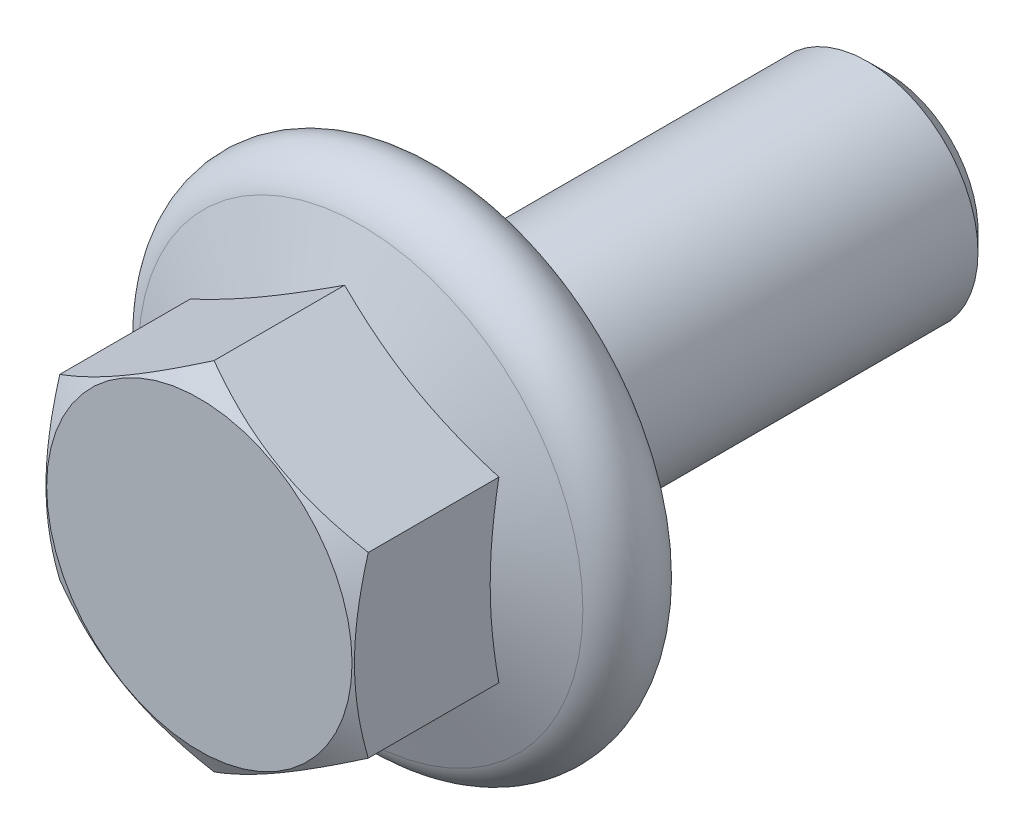
ISO-10303-21;
HEADER;
FILE_DESCRIPTION(('STEP AP214'),'2;1');
FILE_NAME('part.step','',(''),(''),'','','');
FILE_SCHEMA(('AUTOMOTIVE_DESIGN { 1 0 10303 214 1 1 1 1 }'));
ENDSEC;
DATA;
#1=APPLICATION_CONTEXT('core data for automotive mechanical design processes');
#2=APPLICATION_PROTOCOL_DEFINITION('international standard','automotive_design',2000,#1);
#3=PRODUCT_CONTEXT('',#1,'mechanical');
#4=PRODUCT('Part','Part','',(#3));
#5=PRODUCT_RELATED_PRODUCT_CATEGORY('part','',(#4));
#6=PRODUCT_DEFINITION_FORMATION('','',#4);
#7=PRODUCT_DEFINITION_CONTEXT('part definition',#1,'design');
#8=PRODUCT_DEFINITION('design','',#6,#7);
#9=PRODUCT_DEFINITION_SHAPE('','',#8);
#10=(LENGTH_UNIT() NAMED_UNIT(*) SI_UNIT(.MILLI.,.METRE.));
#11=(NAMED_UNIT(*) PLANE_ANGLE_UNIT() SI_UNIT($,.RADIAN.));
#12=(NAMED_UNIT(*) SI_UNIT($,.STERADIAN.) SOLID_ANGLE_UNIT());
#13=UNCERTAINTY_MEASURE_WITH_UNIT(LENGTH_MEASURE(1.E-05),#10,'distance_accuracy_value','');
#14=(GEOMETRIC_REPRESENTATION_CONTEXT(3) GLOBAL_UNCERTAINTY_ASSIGNED_CONTEXT((#13)) GLOBAL_UNIT_ASSIGNED_CONTEXT((#10,
#11,#12)) REPRESENTATION_CONTEXT('',''));
#15=CARTESIAN_POINT('',(0.,0.,0.));
#16=DIRECTION('',(0.,0.,1.));
#17=DIRECTION('',(1.,0.,0.));
#18=AXIS2_PLACEMENT_3D('',#15,#16,#17);
#19=CARTESIAN_POINT('',(204.560324077143,210.601494922169,96.9026873500963));
#20=DIRECTION('',(-0.5,-0.866025403784439,0.));
#21=DIRECTION('',(-0.866025403784439,0.5,0.));
#22=AXIS2_PLACEMENT_3D('',#19,#20,#21);
#23=PLANE('',#22);
#24=CARTESIAN_POINT('',(206.310324077142,209.591131951088,95.9065570345091));
#25=CARTESIAN_POINT('',(206.165381360348,209.674814667646,95.9370250699988));
#26=CARTESIAN_POINT('',(206.019960714806,209.758773316495,95.964740917623));
#27=CARTESIAN_POINT('',(205.728173973312,209.927236470243,96.0135025361833));
#28=CARTESIAN_POINT('',(205.581807228511,210.011741349754,96.0345430888007));
#29=CARTESIAN_POINT('',(205.28975246405,210.180359246634,96.0685755340895));
#30=CARTESIAN_POINT('',(205.144071112869,210.264468413954,96.0816416498096));
#31=CARTESIAN_POINT('',(204.852367767989,210.432883418644,96.0991669712723));
#32=CARTESIAN_POINT('',(204.706345922566,210.517189170406,96.1036294036915));
#33=CARTESIAN_POINT('',(204.414302231719,210.685800673932,96.1036294036915));
#34=CARTESIAN_POINT('',(204.268280386296,210.770106425695,96.0991669712722));
#35=CARTESIAN_POINT('',(203.976577041416,210.938521430385,96.0816416498096));
#36=CARTESIAN_POINT('',(203.830895690235,211.022630597705,96.0685755340895));
#37=CARTESIAN_POINT('',(203.538840925774,211.191248494584,96.0345430888007));
#38=CARTESIAN_POINT('',(203.392474180973,211.275753374096,96.0135025361833));
#39=CARTESIAN_POINT('',(203.100687439479,211.444216527843,95.964740917623));
#40=CARTESIAN_POINT('',(202.955266793937,211.528175176693,95.9370250699988));
#41=CARTESIAN_POINT('',(202.810324077143,211.611857893251,95.906557034509));
#42=B_SPLINE_CURVE_WITH_KNOTS('',3,(#24,#25,#26,#27,#28,#29,#30,#31,#32,#33,#34,#35,#36,#37,#38,
#39,#40,#41),.UNSPECIFIED.,.F.,.F.,(4,2,2,2,2,2,2,2,4),(0.,0.510400948319108,1.02119991788162,
1.52716902069188,2.03294833077693,2.53872764086199,3.04469674367226,3.55549571323478,
4.06589666155387),.UNSPECIFIED.);
#43=CARTESIAN_POINT('',(206.310324077143,209.591131951088,95.9065570345092));
#44=VERTEX_POINT('',#43);
#45=CARTESIAN_POINT('',(202.810324077143,211.611857893251,95.9065570345091));
#46=VERTEX_POINT('',#45);
#47=EDGE_CURVE('E41',#44,#46,#42,.T.);
#48=ORIENTED_EDGE('',*,*,#47,.F.);
#49=DIRECTION('',(0.,0.,1.));
#50=VECTOR('',#49,1.);
#51=CARTESIAN_POINT('',(206.310324077143,209.591131951088,94.6026873500963));
#52=LINE('',#51,#50);
#53=CARTESIAN_POINT('',(206.310324077143,209.591131951088,98.8698726995047));
#54=VERTEX_POINT('',#53);
#55=EDGE_CURVE('E11',#44,#54,#52,.T.);
#56=ORIENTED_EDGE('',*,*,#55,.T.);
#57=CARTESIAN_POINT('',(206.310324077142,209.591131951088,98.8698726995046));
#58=CARTESIAN_POINT('',(206.156520273907,209.679930618288,98.9211554955329));
#59=CARTESIAN_POINT('',(206.00138883843,209.76949579432,98.9677945145792));
#60=CARTESIAN_POINT('',(205.688439970442,209.950176907496,99.0492015215541));
#61=CARTESIAN_POINT('',(205.530616979244,210.041296053948,99.0839407139128));
#62=CARTESIAN_POINT('',(205.216926818064,210.222405152947,99.1380147713488));
#63=CARTESIAN_POINT('',(205.061107899814,210.312367247344,99.1577095712099));
#64=CARTESIAN_POINT('',(204.748737266334,210.492714516671,99.1812166552762));
#65=CARTESIAN_POINT('',(204.592186685708,210.583099036537,99.1850484100496));
#66=CARTESIAN_POINT('',(204.29968872015,210.751972815689,99.1770566917336));
#67=CARTESIAN_POINT('',(204.163697443516,210.830487415861,99.167195450376));
#68=CARTESIAN_POINT('',(203.892600829054,210.987005119197,99.1359474232476));
#69=CARTESIAN_POINT('',(203.757496428179,211.065007681412,99.1145499736593));
#70=CARTESIAN_POINT('',(203.485841329125,211.221847825977,99.0610604911624));
#71=CARTESIAN_POINT('',(203.349324995222,211.300665568105,99.0287418256224));
#72=CARTESIAN_POINT('',(203.078327879634,211.457125825739,98.9553921180356));
#73=CARTESIAN_POINT('',(202.943843628842,211.534770344135,98.9143782991882));
#74=CARTESIAN_POINT('',(202.810324077143,211.611857893251,98.8698726995046));
#75=B_SPLINE_CURVE_WITH_KNOTS('',3,(#57,#58,#59,#60,#61,#62,#63,#64,#65,#66,#67,#68,#69,#70,#71,
#72,#73,#74),.UNSPECIFIED.,.F.,.F.,(4,2,2,2,2,2,2,2,4),(0.,0.554778020224428,1.1108891797974,
1.65323831076753,2.19492155557111,2.66648861960563,3.13849233913985,3.62096283935469,
4.10248645365058),.UNSPECIFIED.);
#76=CARTESIAN_POINT('',(202.810324077143,211.611857893251,98.8698726995046));
#77=VERTEX_POINT('',#76);
#78=EDGE_CURVE('E33',#54,#77,#75,.T.);
#79=ORIENTED_EDGE('',*,*,#78,.T.);
#80=DIRECTION('',(0.,0.,1.));
#81=VECTOR('',#80,1.);
#82=CARTESIAN_POINT('',(202.810324077143,211.611857893251,94.6026873500963));
#83=LINE('',#82,#81);
#84=EDGE_CURVE('E148',#46,#77,#83,.T.);
#85=ORIENTED_EDGE('',*,*,#84,.F.);
#86=EDGE_LOOP('',(#48,#56,#79,#85));
#87=FACE_BOUND('',#86,.T.);
#88=ADVANCED_FACE('F17',(#87),#23,.T.);
#89=CARTESIAN_POINT('',(202.810324077143,213.632583835415,96.9026873500963));
#90=DIRECTION('',(-1.,0.,0.));
#91=DIRECTION('',(0.,1.,0.));
#92=AXIS2_PLACEMENT_3D('',#89,#90,#91);
#93=PLANE('',#92);
#94=CARTESIAN_POINT('',(202.810324077143,211.611857893251,95.9065570345091));
#95=CARTESIAN_POINT('',(202.810324077143,211.779223326367,95.9370250699989));
#96=CARTESIAN_POINT('',(202.810324077143,211.947140624066,95.9647409176231));
#97=CARTESIAN_POINT('',(202.810324077143,212.284066931562,96.0135025361834));
#98=CARTESIAN_POINT('',(202.810324077143,212.453076690584,96.0345430888008));
#99=CARTESIAN_POINT('',(202.810324077143,212.790312484344,96.0685755340896));
#100=CARTESIAN_POINT('',(202.810324077143,212.958530818984,96.0816416498097));
#101=CARTESIAN_POINT('',(202.810324077143,213.295360828364,96.0991669712724));
#102=CARTESIAN_POINT('',(202.810324077143,213.463972331889,96.1036294036916));
#103=CARTESIAN_POINT('',(202.810324077143,213.801195338941,96.1036294036916));
#104=CARTESIAN_POINT('',(202.810324077143,213.969806842466,96.0991669712724));
#105=CARTESIAN_POINT('',(202.810324077143,214.306636851846,96.0816416498097));
#106=CARTESIAN_POINT('',(202.810324077143,214.474855186486,96.0685755340896));
#107=CARTESIAN_POINT('',(202.810324077143,214.812090980246,96.0345430888008));
#108=CARTESIAN_POINT('',(202.810324077143,214.981100739268,96.0135025361834));
#109=CARTESIAN_POINT('',(202.810324077143,215.318027046764,95.9647409176231));
#110=CARTESIAN_POINT('',(202.810324077143,215.485944344463,95.9370250699989));
#111=CARTESIAN_POINT('',(202.810324077143,215.653309777579,95.9065570345091));
#112=B_SPLINE_CURVE_WITH_KNOTS('',3,(#94,#95,#96,#97,#98,#99,#100,#101,#102,#103,#104,#105,#106,
#107,#108,#109,#110,#111),.UNSPECIFIED.,.F.,.F.,(4,2,2,2,2,2,2,2,4),(0.,0.510400948319219,
1.02119991788189,1.5271690206923,2.03294833077753,2.53872764086274,3.04469674367312,
3.55549571323579,4.06589666155504),.UNSPECIFIED.);
#113=CARTESIAN_POINT('',(202.810324077143,215.653309777579,95.9065570345091));
#114=VERTEX_POINT('',#113);
#115=EDGE_CURVE('E255',#46,#114,#112,.T.);
#116=ORIENTED_EDGE('',*,*,#115,.F.);
#117=ORIENTED_EDGE('',*,*,#84,.T.);
#118=CARTESIAN_POINT('',(202.810324077143,211.611857893251,98.8698726995046));
#119=CARTESIAN_POINT('',(202.810324077143,211.789455227652,98.921155495533));
#120=CARTESIAN_POINT('',(202.810324077143,211.968585579716,98.9677945145792));
#121=CARTESIAN_POINT('',(202.810324077143,212.329947806068,99.0492015215542));
#122=CARTESIAN_POINT('',(202.810324077143,212.512186098972,99.083940713913));
#123=CARTESIAN_POINT('',(202.810324077143,212.874404296971,99.138014771349));
#124=CARTESIAN_POINT('',(202.810324077143,213.054328485765,99.1577095712101));
#125=CARTESIAN_POINT('',(202.810324077143,213.415023024418,99.1812166552764));
#126=CARTESIAN_POINT('',(202.810324077143,213.59579206415,99.1850484100498));
#127=CARTESIAN_POINT('',(202.810324077143,213.933539622454,99.1770566917338));
#128=CARTESIAN_POINT('',(202.810324077143,214.090568822799,99.1671954503762));
#129=CARTESIAN_POINT('',(202.810324077143,214.403604229471,99.1359474232479));
#130=CARTESIAN_POINT('',(202.810324077143,214.5596093539,99.1145499736595));
#131=CARTESIAN_POINT('',(202.810324077143,214.873289643031,99.0610604911626));
#132=CARTESIAN_POINT('',(202.810324077143,215.030925127286,99.0287418256226));
#133=CARTESIAN_POINT('',(202.810324077143,215.343845642554,98.9553921180357));
#134=CARTESIAN_POINT('',(202.810324077143,215.499134679348,98.9143782991882));
#135=CARTESIAN_POINT('',(202.810324077143,215.653309777579,98.8698726995046));
#136=B_SPLINE_CURVE_WITH_KNOTS('',3,(#118,#119,#120,#121,#122,#123,#124,#125,#126,#127,#128,
#129,#130,#131,#132,#133,#134,#135),.UNSPECIFIED.,.F.,.F.,(4,2,2,2,2,2,2,2,4),(0.,
0.554778020224514,1.11088917979751,1.65323831076774,2.19492155557139,2.66648861960611,
3.1384923391406,3.62096283935568,4.10248645365181),.UNSPECIFIED.);
#137=CARTESIAN_POINT('',(202.810324077143,215.653309777579,98.8698726995046));
#138=VERTEX_POINT('',#137);
#139=EDGE_CURVE('E150',#77,#138,#136,.T.);
#140=ORIENTED_EDGE('',*,*,#139,.T.);
#141=DIRECTION('',(0.,0.,1.));
#142=VECTOR('',#141,1.);
#143=CARTESIAN_POINT('',(202.810324077143,215.653309777579,94.6026873500963));
#144=LINE('',#143,#142);
#145=EDGE_CURVE('E159',#114,#138,#144,.T.);
#146=ORIENTED_EDGE('',*,*,#145,.F.);
#147=EDGE_LOOP('',(#116,#117,#140,#146));
#148=FACE_BOUND('',#147,.T.);
#149=ADVANCED_FACE('F260',(#148),#93,.T.);
#150=CARTESIAN_POINT('',(204.560324077143,216.663672748661,96.9026873500963));
#151=DIRECTION('',(-0.5,0.866025403784439,0.));
#152=DIRECTION('',(0.866025403784439,0.5,0.));
#153=AXIS2_PLACEMENT_3D('',#150,#151,#152);
#154=PLANE('',#153);
#155=CARTESIAN_POINT('',(202.810324077143,215.653309777579,95.906557034509));
#156=CARTESIAN_POINT('',(202.955266793937,215.736992494137,95.9370250699988));
#157=CARTESIAN_POINT('',(203.100687439479,215.820951142987,95.964740917623));
#158=CARTESIAN_POINT('',(203.392474180973,215.989414296734,96.0135025361833));
#159=CARTESIAN_POINT('',(203.538840925774,216.073919176246,96.0345430888007));
#160=CARTESIAN_POINT('',(203.830895690235,216.242537073125,96.0685755340895));
#161=CARTESIAN_POINT('',(203.976577041416,216.326646240445,96.0816416498096));
#162=CARTESIAN_POINT('',(204.268280386296,216.495061245135,96.0991669712723));
#163=CARTESIAN_POINT('',(204.414302231719,216.579366996898,96.1036294036915));
#164=CARTESIAN_POINT('',(204.706345922566,216.747978500424,96.1036294036915));
#165=CARTESIAN_POINT('',(204.852367767989,216.832284252186,96.0991669712723));
#166=CARTESIAN_POINT('',(205.144071112869,217.000699256876,96.0816416498096));
#167=CARTESIAN_POINT('',(205.28975246405,217.084808424196,96.0685755340895));
#168=CARTESIAN_POINT('',(205.581807228511,217.253426321076,96.0345430888007));
#169=CARTESIAN_POINT('',(205.728173973312,217.337931200587,96.0135025361833));
#170=CARTESIAN_POINT('',(206.019960714806,217.506394354335,95.964740917623));
#171=CARTESIAN_POINT('',(206.165381360348,217.590353003184,95.9370250699988));
#172=CARTESIAN_POINT('',(206.310324077142,217.674035719742,95.906557034509));
#173=B_SPLINE_CURVE_WITH_KNOTS('',3,(#155,#156,#157,#158,#159,#160,#161,#162,#163,#164,#165,
#166,#167,#168,#169,#170,#171,#172),.UNSPECIFIED.,.F.,.F.,(4,2,2,2,2,2,2,2,4),(0.,
0.510400948319082,1.02119991788159,1.52716902069188,2.03294833077694,2.538727640862,
3.04469674367226,3.55549571323477,4.06589666155389),.UNSPECIFIED.);
#174=CARTESIAN_POINT('',(206.310324077143,217.674035719742,95.9065570345091));
#175=VERTEX_POINT('',#174);
#176=EDGE_CURVE('E228',#114,#175,#173,.T.);
#177=ORIENTED_EDGE('',*,*,#176,.F.);
#178=ORIENTED_EDGE('',*,*,#145,.T.);
#179=CARTESIAN_POINT('',(202.810324077143,215.653309777579,98.8698726995045));
#180=CARTESIAN_POINT('',(202.964127880378,215.742108444779,98.9211554955329));
#181=CARTESIAN_POINT('',(203.119259315855,215.831673620812,98.9677945145791));
#182=CARTESIAN_POINT('',(203.432208183844,216.012354733988,99.049201521554));
#183=CARTESIAN_POINT('',(203.590031175041,216.10347388044,99.0839407139128));
#184=CARTESIAN_POINT('',(203.903721336221,216.284582979439,99.1380147713488));
#185=CARTESIAN_POINT('',(204.059540254472,216.374545073836,99.1577095712099));
#186=CARTESIAN_POINT('',(204.371910887952,216.554892343162,99.1812166552762));
#187=CARTESIAN_POINT('',(204.528461468577,216.645276863029,99.1850484100496));
#188=CARTESIAN_POINT('',(204.820959434135,216.814150642181,99.1770566917336));
#189=CARTESIAN_POINT('',(204.95695071077,216.892665242353,99.167195450376));
#190=CARTESIAN_POINT('',(205.228047325231,217.049182945689,99.1359474232477));
#191=CARTESIAN_POINT('',(205.363151726107,217.127185507903,99.1145499736593));
#192=CARTESIAN_POINT('',(205.634806825161,217.284025652469,99.0610604911624));
#193=CARTESIAN_POINT('',(205.771323159064,217.362843394596,99.0287418256224));
#194=CARTESIAN_POINT('',(206.042320274651,217.51930365223,98.9553921180356));
#195=CARTESIAN_POINT('',(206.176804525443,217.596948170627,98.9143782991882));
#196=CARTESIAN_POINT('',(206.310324077142,217.674035719742,98.8698726995045));
#197=B_SPLINE_CURVE_WITH_KNOTS('',3,(#179,#180,#181,#182,#183,#184,#185,#186,#187,#188,#189,
#190,#191,#192,#193,#194,#195,#196),.UNSPECIFIED.,.F.,.F.,(4,2,2,2,2,2,2,2,4),(0.,
0.55477802022457,1.11088917979756,1.6532383107678,2.19492155557141,2.66648861960583,
3.13849233914004,3.6209628393548,4.10248645365063),.UNSPECIFIED.);
#198=CARTESIAN_POINT('',(206.310324077143,217.674035719742,98.8698726995047));
#199=VERTEX_POINT('',#198);
#200=EDGE_CURVE('E158',#138,#199,#197,.T.);
#201=ORIENTED_EDGE('',*,*,#200,.T.);
#202=DIRECTION('',(0.,0.,1.));
#203=VECTOR('',#202,1.);
#204=CARTESIAN_POINT('',(206.310324077143,217.674035719742,94.6026873500963));
#205=LINE('',#204,#203);
#206=EDGE_CURVE('E156',#175,#199,#205,.T.);
#207=ORIENTED_EDGE('',*,*,#206,.F.);
#208=EDGE_LOOP('',(#177,#178,#201,#207));
#209=FACE_BOUND('',#208,.T.);
#210=ADVANCED_FACE('F219',(#209),#154,.T.);
#211=CARTESIAN_POINT('',(208.060324077143,216.663672748661,96.9026873500963));
#212=DIRECTION('',(0.5,0.866025403784439,0.));
#213=DIRECTION('',(0.866025403784439,-0.5,0.));
#214=AXIS2_PLACEMENT_3D('',#211,#212,#213);
#215=PLANE('',#214);
#216=CARTESIAN_POINT('',(206.310324077143,217.674035719742,95.906557034509));
#217=CARTESIAN_POINT('',(206.455266793938,217.590353003184,95.9370250699988));
#218=CARTESIAN_POINT('',(206.60068743948,217.506394354335,95.964740917623));
#219=CARTESIAN_POINT('',(206.892474180974,217.337931200587,96.0135025361833));
#220=CARTESIAN_POINT('',(207.038840925775,217.253426321076,96.0345430888007));
#221=CARTESIAN_POINT('',(207.330895690236,217.084808424196,96.0685755340895));
#222=CARTESIAN_POINT('',(207.476577041417,217.000699256876,96.0816416498096));
#223=CARTESIAN_POINT('',(207.768280386297,216.832284252186,96.0991669712723));
#224=CARTESIAN_POINT('',(207.91430223172,216.747978500424,96.1036294036915));
#225=CARTESIAN_POINT('',(208.206345922567,216.579366996898,96.1036294036915));
#226=CARTESIAN_POINT('',(208.35236776799,216.495061245135,96.0991669712723));
#227=CARTESIAN_POINT('',(208.64407111287,216.326646240445,96.0816416498096));
#228=CARTESIAN_POINT('',(208.789752464051,216.242537073125,96.0685755340895));
#229=CARTESIAN_POINT('',(209.081807228512,216.073919176246,96.0345430888007));
#230=CARTESIAN_POINT('',(209.228173973313,215.989414296734,96.0135025361833));
#231=CARTESIAN_POINT('',(209.519960714807,215.820951142987,95.964740917623));
#232=CARTESIAN_POINT('',(209.665381360349,215.736992494137,95.9370250699988));
#233=CARTESIAN_POINT('',(209.810324077143,215.653309777579,95.906557034509));
#234=B_SPLINE_CURVE_WITH_KNOTS('',3,(#216,#217,#218,#219,#220,#221,#222,#223,#224,#225,#226,
#227,#228,#229,#230,#231,#232,#233),.UNSPECIFIED.,.F.,.F.,(4,2,2,2,2,2,2,2,4),(0.,
0.5104009483191,1.02119991788161,1.52716902069191,2.03294833077696,2.53872764086201,
3.04469674367227,3.55549571323478,4.06589666155387),.UNSPECIFIED.);
#235=CARTESIAN_POINT('',(209.810324077143,215.653309777579,95.9065570345091));
#236=VERTEX_POINT('',#235);
#237=EDGE_CURVE('E64',#175,#236,#234,.T.);
#238=ORIENTED_EDGE('',*,*,#237,.F.);
#239=ORIENTED_EDGE('',*,*,#206,.T.);
#240=CARTESIAN_POINT('',(206.310324077143,217.674035719742,98.8698726995045));
#241=CARTESIAN_POINT('',(206.464127880379,217.585237052542,98.9211554955329));
#242=CARTESIAN_POINT('',(206.619259315856,217.49567187651,98.9677945145792));
#243=CARTESIAN_POINT('',(206.932208183844,217.314990763334,99.0492015215541));
#244=CARTESIAN_POINT('',(207.090031175042,217.223871616882,99.0839407139129));
#245=CARTESIAN_POINT('',(207.403721336221,217.042762517883,99.1380147713488));
#246=CARTESIAN_POINT('',(207.559540254472,216.952800423486,99.1577095712099));
#247=CARTESIAN_POINT('',(207.871910887952,216.772453154159,99.1812166552762));
#248=CARTESIAN_POINT('',(208.028461468578,216.682068634293,99.1850484100496));
#249=CARTESIAN_POINT('',(208.320959434136,216.513194855141,99.1770566917336));
#250=CARTESIAN_POINT('',(208.45695071077,216.434680254969,99.167195450376));
#251=CARTESIAN_POINT('',(208.728047325232,216.278162551633,99.1359474232477));
#252=CARTESIAN_POINT('',(208.863151726108,216.200159989418,99.1145499736593));
#253=CARTESIAN_POINT('',(209.134806825161,216.043319844853,99.0610604911624));
#254=CARTESIAN_POINT('',(209.271323159064,215.964502102725,99.0287418256224));
#255=CARTESIAN_POINT('',(209.542320274652,215.808041845091,98.9553921180356));
#256=CARTESIAN_POINT('',(209.676804525444,215.730397326695,98.9143782991881));
#257=CARTESIAN_POINT('',(209.810324077143,215.653309777579,98.8698726995045));
#258=B_SPLINE_CURVE_WITH_KNOTS('',3,(#240,#241,#242,#243,#244,#245,#246,#247,#248,#249,#250,
#251,#252,#253,#254,#255,#256,#257),.UNSPECIFIED.,.F.,.F.,(4,2,2,2,2,2,2,2,4),(0.,
0.554778020224469,1.11088917979736,1.65323831076751,2.19492155557111,2.66648861960565,
3.1384923391399,3.62096283935474,4.10248645365061),.UNSPECIFIED.);
#259=CARTESIAN_POINT('',(209.810324077143,215.653309777579,98.8698726995046));
#260=VERTEX_POINT('',#259);
#261=EDGE_CURVE('E155',#199,#260,#258,.T.);
#262=ORIENTED_EDGE('',*,*,#261,.T.);
#263=DIRECTION('',(0.,0.,1.));
#264=VECTOR('',#263,1.);
#265=CARTESIAN_POINT('',(209.810324077143,215.653309777579,94.6026873500963));
#266=LINE('',#265,#264);
#267=EDGE_CURVE('E153',#236,#260,#266,.T.);
#268=ORIENTED_EDGE('',*,*,#267,.F.);
#269=EDGE_LOOP('',(#238,#239,#262,#268));
#270=FACE_BOUND('',#269,.T.);
#271=ADVANCED_FACE('F214',(#270),#215,.T.);
#272=CARTESIAN_POINT('',(209.810324077143,213.632583835415,96.9026873500963));
#273=DIRECTION('',(1.,0.,0.));
#274=DIRECTION('',(0.,-1.,0.));
#275=AXIS2_PLACEMENT_3D('',#272,#273,#274);
#276=PLANE('',#275);
#277=CARTESIAN_POINT('',(209.810324077143,215.653309777579,95.9065570345091));
#278=CARTESIAN_POINT('',(209.810324077143,215.485944344463,95.9370250699989));
#279=CARTESIAN_POINT('',(209.810324077143,215.318027046764,95.9647409176231));
#280=CARTESIAN_POINT('',(209.810324077143,214.981100739268,96.0135025361834));
#281=CARTESIAN_POINT('',(209.810324077143,214.812090980246,96.0345430888008));
#282=CARTESIAN_POINT('',(209.810324077143,214.474855186486,96.0685755340896));
#283=CARTESIAN_POINT('',(209.810324077143,214.306636851846,96.0816416498097));
#284=CARTESIAN_POINT('',(209.810324077143,213.969806842466,96.0991669712724));
#285=CARTESIAN_POINT('',(209.810324077143,213.801195338941,96.1036294036916));
#286=CARTESIAN_POINT('',(209.810324077143,213.463972331889,96.1036294036916));
#287=CARTESIAN_POINT('',(209.810324077143,213.295360828364,96.0991669712724));
#288=CARTESIAN_POINT('',(209.810324077143,212.958530818984,96.0816416498097));
#289=CARTESIAN_POINT('',(209.810324077143,212.790312484344,96.0685755340896));
#290=CARTESIAN_POINT('',(209.810324077143,212.453076690584,96.0345430888008));
#291=CARTESIAN_POINT('',(209.810324077143,212.284066931562,96.0135025361834));
#292=CARTESIAN_POINT('',(209.810324077143,211.947140624066,95.9647409176231));
#293=CARTESIAN_POINT('',(209.810324077143,211.779223326367,95.9370250699989));
#294=CARTESIAN_POINT('',(209.810324077143,211.611857893251,95.9065570345091));
#295=B_SPLINE_CURVE_WITH_KNOTS('',3,(#277,#278,#279,#280,#281,#282,#283,#284,#285,#286,#287,
#288,#289,#290,#291,#292,#293,#294),.UNSPECIFIED.,.F.,.F.,(4,2,2,2,2,2,2,2,4),(0.,
0.510400948319247,1.02119991788192,1.5271690206923,2.03294833077751,2.53872764086275,
3.04469674367315,3.55549571323582,4.06589666155504),.UNSPECIFIED.);
#296=CARTESIAN_POINT('',(209.810324077143,211.611857893251,95.9065570345091));
#297=VERTEX_POINT('',#296);
#298=EDGE_CURVE('E21',#236,#297,#295,.T.);
#299=ORIENTED_EDGE('',*,*,#298,.F.);
#300=ORIENTED_EDGE('',*,*,#267,.T.);
#301=CARTESIAN_POINT('',(209.810324077143,215.653309777579,98.8698726995046));
#302=CARTESIAN_POINT('',(209.810324077143,215.475712443178,98.921155495533));
#303=CARTESIAN_POINT('',(209.810324077143,215.296582091114,98.9677945145792));
#304=CARTESIAN_POINT('',(209.810324077143,214.935219864762,99.0492015215542));
#305=CARTESIAN_POINT('',(209.810324077143,214.752981571858,99.083940713913));
#306=CARTESIAN_POINT('',(209.810324077143,214.390763373859,99.138014771349));
#307=CARTESIAN_POINT('',(209.810324077143,214.210839185065,99.1577095712101));
#308=CARTESIAN_POINT('',(209.810324077143,213.850144646412,99.1812166552764));
#309=CARTESIAN_POINT('',(209.810324077143,213.66937560668,99.1850484100498));
#310=CARTESIAN_POINT('',(209.810324077143,213.331628048376,99.1770566917338));
#311=CARTESIAN_POINT('',(209.810324077143,213.174598848031,99.1671954503762));
#312=CARTESIAN_POINT('',(209.810324077143,212.861563441359,99.1359474232479));
#313=CARTESIAN_POINT('',(209.810324077143,212.70555831693,99.1145499736595));
#314=CARTESIAN_POINT('',(209.810324077143,212.391878027799,99.0610604911626));
#315=CARTESIAN_POINT('',(209.810324077143,212.234242543544,99.0287418256226));
#316=CARTESIAN_POINT('',(209.810324077143,211.921322028276,98.9553921180357));
#317=CARTESIAN_POINT('',(209.810324077143,211.766032991482,98.9143782991882));
#318=CARTESIAN_POINT('',(209.810324077143,211.611857893251,98.8698726995046));
#319=B_SPLINE_CURVE_WITH_KNOTS('',3,(#301,#302,#303,#304,#305,#306,#307,#308,#309,#310,#311,
#312,#313,#314,#315,#316,#317,#318),.UNSPECIFIED.,.F.,.F.,(4,2,2,2,2,2,2,2,4),(0.,
0.554778020224544,1.11088917979751,1.65323831076771,2.19492155557133,2.66648861960608,
3.13849233914057,3.62096283935568,4.10248645365181),.UNSPECIFIED.);
#320=CARTESIAN_POINT('',(209.810324077143,211.611857893251,98.8698726995046));
#321=VERTEX_POINT('',#320);
#322=EDGE_CURVE('E152',#260,#321,#319,.T.);
#323=ORIENTED_EDGE('',*,*,#322,.T.);
#324=DIRECTION('',(0.,0.,1.));
#325=VECTOR('',#324,1.);
#326=CARTESIAN_POINT('',(209.810324077143,211.611857893251,94.6026873500963));
#327=LINE('',#326,#325);
#328=EDGE_CURVE('E73',#297,#321,#327,.T.);
#329=ORIENTED_EDGE('',*,*,#328,.F.);
#330=EDGE_LOOP('',(#299,#300,#323,#329));
#331=FACE_BOUND('',#330,.T.);
#332=ADVANCED_FACE('F211',(#331),#276,.T.);
#333=CARTESIAN_POINT('',(208.060324077143,210.601494922169,96.9026873500963));
#334=DIRECTION('',(0.5,-0.866025403784439,0.));
#335=DIRECTION('',(-0.866025403784439,-0.5,0.));
#336=AXIS2_PLACEMENT_3D('',#333,#334,#335);
#337=PLANE('',#336);
#338=CARTESIAN_POINT('',(209.810324077143,211.611857893251,95.906557034509));
#339=CARTESIAN_POINT('',(209.665381360349,211.528175176693,95.9370250699988));
#340=CARTESIAN_POINT('',(209.519960714807,211.444216527843,95.964740917623));
#341=CARTESIAN_POINT('',(209.228173973313,211.275753374096,96.0135025361833));
#342=CARTESIAN_POINT('',(209.081807228512,211.191248494584,96.0345430888007));
#343=CARTESIAN_POINT('',(208.789752464051,211.022630597705,96.0685755340895));
#344=CARTESIAN_POINT('',(208.64407111287,210.938521430385,96.0816416498096));
#345=CARTESIAN_POINT('',(208.35236776799,210.770106425695,96.0991669712722));
#346=CARTESIAN_POINT('',(208.206345922567,210.685800673932,96.1036294036915));
#347=CARTESIAN_POINT('',(207.91430223172,210.517189170406,96.1036294036915));
#348=CARTESIAN_POINT('',(207.768280386297,210.432883418644,96.0991669712723));
#349=CARTESIAN_POINT('',(207.476577041417,210.264468413954,96.0816416498096));
#350=CARTESIAN_POINT('',(207.330895690236,210.180359246634,96.0685755340895));
#351=CARTESIAN_POINT('',(207.038840925775,210.011741349754,96.0345430888007));
#352=CARTESIAN_POINT('',(206.892474180974,209.927236470243,96.0135025361833));
#353=CARTESIAN_POINT('',(206.60068743948,209.758773316495,95.964740917623));
#354=CARTESIAN_POINT('',(206.455266793938,209.674814667646,95.9370250699988));
#355=CARTESIAN_POINT('',(206.310324077143,209.591131951088,95.9065570345091));
#356=B_SPLINE_CURVE_WITH_KNOTS('',3,(#338,#339,#340,#341,#342,#343,#344,#345,#346,#347,#348,
#349,#350,#351,#352,#353,#354,#355),.UNSPECIFIED.,.F.,.F.,(4,2,2,2,2,2,2,2,4),(0.,
0.51040094831908,1.02119991788157,1.52716902069185,2.03294833077693,2.53872764086199,
3.04469674367225,3.55549571323473,4.06589666155385),.UNSPECIFIED.);
#357=EDGE_CURVE('E121',#297,#44,#356,.T.);
#358=ORIENTED_EDGE('',*,*,#357,.F.);
#359=ORIENTED_EDGE('',*,*,#328,.T.);
#360=CARTESIAN_POINT('',(209.810324077143,211.611857893251,98.8698726995045));
#361=CARTESIAN_POINT('',(209.656520273908,211.523059226051,98.9211554955329));
#362=CARTESIAN_POINT('',(209.501388838431,211.433494050018,98.9677945145791));
#363=CARTESIAN_POINT('',(209.188439970442,211.252812936842,99.049201521554));
#364=CARTESIAN_POINT('',(209.030616979245,211.16169379039,99.0839407139128));
#365=CARTESIAN_POINT('',(208.716926818065,210.980584691391,99.1380147713488));
#366=CARTESIAN_POINT('',(208.561107899814,210.890622596994,99.1577095712099));
#367=CARTESIAN_POINT('',(208.248737266334,210.710275327668,99.1812166552762));
#368=CARTESIAN_POINT('',(208.092186685709,210.619890807801,99.1850484100496));
#369=CARTESIAN_POINT('',(207.799688720151,210.451017028649,99.1770566917336));
#370=CARTESIAN_POINT('',(207.663697443516,210.372502428477,99.167195450376));
#371=CARTESIAN_POINT('',(207.392600829055,210.215984725141,99.1359474232477));
#372=CARTESIAN_POINT('',(207.257496428179,210.137982162927,99.1145499736593));
#373=CARTESIAN_POINT('',(206.985841329125,209.981142018361,99.0610604911624));
#374=CARTESIAN_POINT('',(206.849324995222,209.902324276234,99.0287418256224));
#375=CARTESIAN_POINT('',(206.578327879635,209.7458640186,98.9553921180357));
#376=CARTESIAN_POINT('',(206.443843628843,209.668219500203,98.9143782991882));
#377=CARTESIAN_POINT('',(206.310324077143,209.591131951088,98.8698726995046));
#378=B_SPLINE_CURVE_WITH_KNOTS('',3,(#360,#361,#362,#363,#364,#365,#366,#367,#368,#369,#370,
#371,#372,#373,#374,#375,#376,#377),.UNSPECIFIED.,.F.,.F.,(4,2,2,2,2,2,2,2,4),(0.,
0.554778020224543,1.11088917979756,1.65323831076776,2.19492155557137,2.66648861960577,
3.13849233914,3.62096283935473,4.10248645365058),.UNSPECIFIED.);
#379=EDGE_CURVE('E116',#321,#54,#378,.T.);
#380=ORIENTED_EDGE('',*,*,#379,.T.);
#381=ORIENTED_EDGE('',*,*,#55,.F.);
#382=EDGE_LOOP('',(#358,#359,#380,#381));
#383=FACE_BOUND('',#382,.T.);
#384=ADVANCED_FACE('F181',(#383),#337,.T.);
#385=CARTESIAN_POINT('',(206.310324077143,213.632583835415,101.203206032838));
#386=DIRECTION('',(0.,0.,-1.));
#387=DIRECTION('',(1.,0.,0.));
#388=AXIS2_PLACEMENT_3D('',#385,#386,#387);
#389=CONICAL_SURFACE('',#388,0.,1.0471975511966);
#390=ORIENTED_EDGE('',*,*,#78,.F.);
#391=ORIENTED_EDGE('',*,*,#379,.F.);
#392=ORIENTED_EDGE('',*,*,#322,.F.);
#393=ORIENTED_EDGE('',*,*,#261,.F.);
#394=ORIENTED_EDGE('',*,*,#200,.F.);
#395=ORIENTED_EDGE('',*,*,#139,.F.);
#396=EDGE_LOOP('',(#390,#391,#392,#393,#394,#395));
#397=FACE_BOUND('',#396,.T.);
#398=CARTESIAN_POINT('',(206.310324077143,213.632583835415,99.2026873500963));
#399=DIRECTION('',(0.,0.,1.));
#400=DIRECTION('',(1.,0.,0.));
#401=AXIS2_PLACEMENT_3D('',#398,#399,#400);
#402=CIRCLE('',#401,3.465);
#403=CARTESIAN_POINT('',(209.775324077143,213.632583835415,99.2026873500963));
#404=VERTEX_POINT('',#403);
#405=EDGE_CURVE('E113',#404,#404,#402,.T.);
#406=ORIENTED_EDGE('',*,*,#405,.F.);
#407=EDGE_LOOP('',(#406));
#408=FACE_BOUND('',#407,.T.);
#409=ADVANCED_FACE('F114',(#397,#408),#389,.T.);
#410=CARTESIAN_POINT('',(206.310324077143,213.632583835415,99.2026873500963));
#411=DIRECTION('',(0.,0.,1.));
#412=DIRECTION('',(-1.,0.,0.));
#413=AXIS2_PLACEMENT_3D('',#410,#411,#412);
#414=PLANE('',#413);
#415=ORIENTED_EDGE('',*,*,#405,.T.);
#416=EDGE_LOOP('',(#415));
#417=FACE_BOUND('',#416,.T.);
#418=ADVANCED_FACE('F180',(#417),#414,.T.);
#419=CARTESIAN_POINT('',(206.310324077143,213.632583835415,93.6026873500963));
#420=DIRECTION('',(0.,0.,-1.));
#421=DIRECTION('',(1.,0.,0.));
#422=AXIS2_PLACEMENT_3D('',#419,#420,#421);
#423=PLANE('',#422);
#424=CARTESIAN_POINT('',(206.310324077143,213.632583835415,93.6026873500963));
#425=DIRECTION('',(0.,0.,-1.));
#426=DIRECTION('',(-1.,0.,0.));
#427=AXIS2_PLACEMENT_3D('',#424,#425,#426);
#428=CIRCLE('',#427,3.05551918177834);
#429=CARTESIAN_POINT('',(203.254804895365,213.632583835415,93.6026873500963));
#430=VERTEX_POINT('',#429);
#431=EDGE_CURVE('E124',#430,#430,#428,.T.);
#432=ORIENTED_EDGE('',*,*,#431,.F.);
#433=EDGE_LOOP('',(#432));
#434=FACE_BOUND('',#433,.T.);
#435=CARTESIAN_POINT('',(206.310324077143,213.632583835415,93.6026873500963));
#436=DIRECTION('',(0.,0.,-1.));
#437=DIRECTION('',(-1.,0.,0.));
#438=AXIS2_PLACEMENT_3D('',#435,#436,#437);
#439=CIRCLE('',#438,4.7);
#440=CARTESIAN_POINT('',(201.610324077143,213.632583835415,93.6026873500963));
#441=VERTEX_POINT('',#440);
#442=EDGE_CURVE('E117',#441,#441,#439,.T.);
#443=ORIENTED_EDGE('',*,*,#442,.T.);
#444=EDGE_LOOP('',(#443));
#445=FACE_BOUND('',#444,.T.);
#446=ADVANCED_FACE('F239',(#434,#445),#423,.T.);
#447=CARTESIAN_POINT('',(206.310324077143,213.632583835415,96.4026873500963));
#448=DIRECTION('',(0.,0.,-1.));
#449=DIRECTION('',(1.,0.,0.));
#450=AXIS2_PLACEMENT_3D('',#447,#448,#449);
#451=CONICAL_SURFACE('',#450,2.67834504514476,1.22173047639603);
#452=ORIENTED_EDGE('',*,*,#357,.T.);
#453=ORIENTED_EDGE('',*,*,#47,.T.);
#454=ORIENTED_EDGE('',*,*,#115,.T.);
#455=ORIENTED_EDGE('',*,*,#176,.T.);
#456=ORIENTED_EDGE('',*,*,#237,.T.);
#457=ORIENTED_EDGE('',*,*,#298,.T.);
#458=EDGE_LOOP('',(#452,#453,#454,#455,#456,#457));
#459=FACE_BOUND('',#458,.T.);
#460=CARTESIAN_POINT('',(206.310324077143,213.632583835415,95.5423799708822));
#461=DIRECTION('',(0.,0.,1.));
#462=DIRECTION('',(1.,0.,0.));
#463=AXIS2_PLACEMENT_3D('',#460,#461,#462);
#464=CIRCLE('',#463,5.04202014332566);
#465=CARTESIAN_POINT('',(211.352344220469,213.632583835415,95.5423799708822));
#466=VERTEX_POINT('',#465);
#467=EDGE_CURVE('E129',#466,#466,#464,.T.);
#468=ORIENTED_EDGE('',*,*,#467,.T.);
#469=EDGE_LOOP('',(#468));
#470=FACE_BOUND('',#469,.T.);
#471=ADVANCED_FACE('F234',(#459,#470),#451,.T.);
#472=CARTESIAN_POINT('',(206.310324077143,213.632583835415,94.6026873500963));
#473=DIRECTION('',(0.,0.,-1.));
#474=DIRECTION('',(1.,0.,0.));
#475=AXIS2_PLACEMENT_3D('',#472,#473,#474);
#476=TOROIDAL_SURFACE('',#475,4.7,1.);
#477=ORIENTED_EDGE('',*,*,#442,.F.);
#478=EDGE_LOOP('',(#477));
#479=FACE_BOUND('',#478,.T.);
#480=ORIENTED_EDGE('',*,*,#467,.F.);
#481=EDGE_LOOP('',(#480));
#482=FACE_BOUND('',#481,.T.);
#483=ADVANCED_FACE('F238',(#479,#482),#476,.T.);
#484=CARTESIAN_POINT('',(206.310324077143,213.632583835415,93.6526873500963));
#485=DIRECTION('',(0.,0.,-1.));
#486=DIRECTION('',(1.,0.,0.));
#487=AXIS2_PLACEMENT_3D('',#484,#485,#486);
#488=TOROIDAL_SURFACE('',#487,2.86187001446222,0.1);
#489=CARTESIAN_POINT('',(206.310324077143,213.632583835415,93.6721492339552));
#490=DIRECTION('',(0.,0.,1.));
#491=DIRECTION('',(-1.,0.,0.));
#492=AXIS2_PLACEMENT_3D('',#489,#490,#491);
#493=CIRCLE('',#492,2.76378211981328);
#494=CARTESIAN_POINT('',(203.54654195733,213.632583835415,93.6721492339552));
#495=VERTEX_POINT('',#494);
#496=EDGE_CURVE('E126',#495,#495,#493,.T.);
#497=ORIENTED_EDGE('',*,*,#496,.T.);
#498=EDGE_LOOP('',(#497));
#499=FACE_BOUND('',#498,.T.);
#500=CARTESIAN_POINT('',(206.310324077143,213.632583835415,93.677687350097));
#501=DIRECTION('',(0.,0.,1.));
#502=DIRECTION('',(-1.,0.,0.));
#503=AXIS2_PLACEMENT_3D('',#500,#501,#502);
#504=CIRCLE('',#503,2.95869459812297);
#505=CARTESIAN_POINT('',(203.35162947902,213.632583835415,93.677687350097));
#506=VERTEX_POINT('',#505);
#507=EDGE_CURVE('E127',#506,#506,#504,.T.);
#508=ORIENTED_EDGE('',*,*,#507,.F.);
#509=EDGE_LOOP('',(#508));
#510=FACE_BOUND('',#509,.T.);
#511=ADVANCED_FACE('F318',(#499,#510),#488,.F.);
#512=CARTESIAN_POINT('',(206.310324077143,213.632583835415,93.7026873500963));
#513=DIRECTION('',(0.,0.,-1.));
#514=DIRECTION('',(1.,0.,0.));
#515=AXIS2_PLACEMENT_3D('',#512,#513,#514);
#516=TOROIDAL_SURFACE('',#515,3.05551918177834,0.1);
#517=ORIENTED_EDGE('',*,*,#431,.T.);
#518=EDGE_LOOP('',(#517));
#519=FACE_BOUND('',#518,.T.);
#520=ORIENTED_EDGE('',*,*,#507,.T.);
#521=EDGE_LOOP('',(#520));
#522=FACE_BOUND('',#521,.T.);
#523=ADVANCED_FACE('F325',(#519,#522),#516,.T.);
#524=CARTESIAN_POINT('',(206.310324077143,213.632583835415,83.6026873500963));
#525=DIRECTION('',(0.,0.,-1.));
#526=DIRECTION('',(1.,0.,0.));
#527=AXIS2_PLACEMENT_3D('',#524,#525,#526);
#528=PLANE('',#527);
#529=CARTESIAN_POINT('',(206.310324077143,213.632583835415,83.6026873500963));
#530=DIRECTION('',(0.,0.,-1.));
#531=DIRECTION('',(-1.,0.,0.));
#532=AXIS2_PLACEMENT_3D('',#529,#530,#531);
#533=CIRCLE('',#532,2.0669872984);
#534=CARTESIAN_POINT('',(204.243336778743,213.632583835415,83.6026873500963));
#535=VERTEX_POINT('',#534);
#536=EDGE_CURVE('E136',#535,#535,#533,.T.);
#537=ORIENTED_EDGE('',*,*,#536,.T.);
#538=EDGE_LOOP('',(#537));
#539=FACE_BOUND('',#538,.T.);
#540=ADVANCED_FACE('F332',(#539),#528,.T.);
#541=CARTESIAN_POINT('',(206.310324077143,213.632583835415,92.3426873500963));
#542=DIRECTION('',(0.,0.,-1.));
#543=DIRECTION('',(1.,0.,0.));
#544=AXIS2_PLACEMENT_3D('',#541,#542,#543);
#545=CYLINDRICAL_SURFACE('',#544,2.5);
#546=CARTESIAN_POINT('',(206.310324077143,213.632583835415,84.0357000516963));
#547=DIRECTION('',(0.,0.,1.));
#548=DIRECTION('',(-1.,0.,0.));
#549=AXIS2_PLACEMENT_3D('',#546,#547,#548);
#550=CIRCLE('',#549,2.5);
#551=CARTESIAN_POINT('',(203.810324077143,213.632583835415,84.0357000516963));
#552=VERTEX_POINT('',#551);
#553=EDGE_CURVE('E139',#552,#552,#550,.T.);
#554=ORIENTED_EDGE('',*,*,#553,.T.);
#555=EDGE_LOOP('',(#554));
#556=FACE_BOUND('',#555,.T.);
#557=CARTESIAN_POINT('',(206.310324077143,213.632583835415,92.0479411634087));
#558=DIRECTION('',(0.,0.,-1.));
#559=DIRECTION('',(1.,0.,0.));
#560=AXIS2_PLACEMENT_3D('',#557,#558,#559);
#561=CIRCLE('',#560,2.5);
#562=CARTESIAN_POINT('',(208.810324077143,213.632583835415,92.0479411634087));
#563=VERTEX_POINT('',#562);
#564=EDGE_CURVE('E142',#563,#563,#561,.T.);
#565=ORIENTED_EDGE('',*,*,#564,.T.);
#566=EDGE_LOOP('',(#565));
#567=FACE_BOUND('',#566,.T.);
#568=ADVANCED_FACE('F340',(#556,#567),#545,.T.);
#569=CARTESIAN_POINT('',(206.310324077143,213.632583835415,92.3426873500963));
#570=DIRECTION('',(0.,0.,1.));
#571=DIRECTION('',(-1.,0.,0.));
#572=AXIS2_PLACEMENT_3D('',#569,#570,#571);
#573=CONICAL_SURFACE('',#572,2.5,0.195868843478818);
#574=CARTESIAN_POINT('',(206.310324077143,213.632583835415,92.6317976791762));
#575=DIRECTION('',(0.,0.,1.));
#576=DIRECTION('',(1.,0.,0.));
#577=AXIS2_PLACEMENT_3D('',#574,#575,#576);
#578=CIRCLE('',#577,2.55736316053173);
#579=CARTESIAN_POINT('',(208.867687237675,213.632583835415,92.6317976791762));
#580=VERTEX_POINT('',#579);
#581=EDGE_CURVE('E145',#580,#580,#578,.T.);
#582=ORIENTED_EDGE('',*,*,#581,.T.);
#583=EDGE_LOOP('',(#582));
#584=FACE_BOUND('',#583,.T.);
#585=ORIENTED_EDGE('',*,*,#496,.F.);
#586=EDGE_LOOP('',(#585));
#587=FACE_BOUND('',#586,.T.);
#588=ADVANCED_FACE('F348',(#584,#587),#573,.T.);
#589=CARTESIAN_POINT('',(206.310324077143,213.632583835415,92.0479411634087));
#590=DIRECTION('',(0.,0.,1.));
#591=DIRECTION('',(-1.,0.,0.));
#592=AXIS2_PLACEMENT_3D('',#589,#590,#591);
#593=TOROIDAL_SURFACE('',#592,5.5,3.);
#594=ORIENTED_EDGE('',*,*,#564,.F.);
#595=EDGE_LOOP('',(#594));
#596=FACE_BOUND('',#595,.T.);
#597=ORIENTED_EDGE('',*,*,#581,.F.);
#598=EDGE_LOOP('',(#597));
#599=FACE_BOUND('',#598,.T.);
#600=ADVANCED_FACE('F356',(#596,#599),#593,.F.);
#601=CARTESIAN_POINT('',(206.310324077143,213.632583835415,84.0357000516963));
#602=DIRECTION('',(0.,0.,1.));
#603=DIRECTION('',(-1.,0.,0.));
#604=AXIS2_PLACEMENT_3D('',#601,#602,#603);
#605=CONICAL_SURFACE('',#604,2.5,0.785398163397448);
#606=ORIENTED_EDGE('',*,*,#536,.F.);
#607=EDGE_LOOP('',(#606));
#608=FACE_BOUND('',#607,.T.);
#609=ORIENTED_EDGE('',*,*,#553,.F.);
#610=EDGE_LOOP('',(#609));
#611=FACE_BOUND('',#610,.T.);
#612=ADVANCED_FACE('F19',(#608,#611),#605,.T.);
#613=CLOSED_SHELL('',(#88,#149,#210,#271,#332,#384,#409,#418,#446,#471,#483,#511,#523,#540,#568,
#588,#600,#612));
#614=MANIFOLD_SOLID_BREP('B1',#613);
#615=ADVANCED_BREP_SHAPE_REPRESENTATION('',(#18,#614),#14);
#616=SHAPE_DEFINITION_REPRESENTATION(#9,#615);
ENDSEC;
END-ISO-10303-21;
